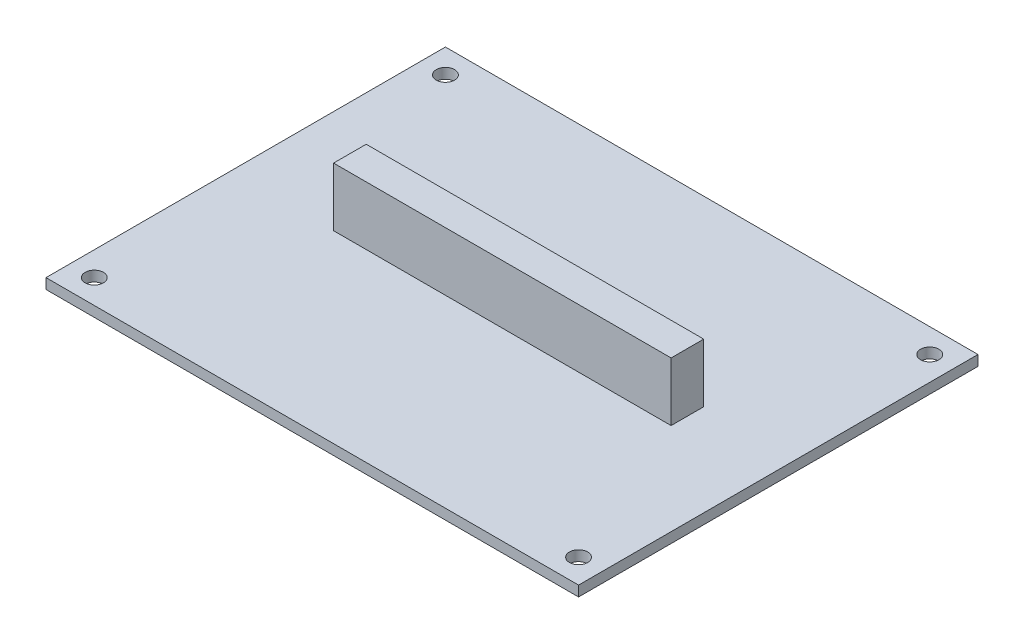
ISO-10303-21;
HEADER;
FILE_DESCRIPTION(('STEP AP214'),'2;1');
FILE_NAME('part.step','',(''),(''),'','','');
FILE_SCHEMA(('AUTOMOTIVE_DESIGN { 1 0 10303 214 1 1 1 1 }'));
ENDSEC;
DATA;
#1=APPLICATION_CONTEXT('core data for automotive mechanical design processes');
#2=APPLICATION_PROTOCOL_DEFINITION('international standard','automotive_design',2000,#1);
#3=PRODUCT_CONTEXT('',#1,'mechanical');
#4=PRODUCT('Part','Part','',(#3));
#5=PRODUCT_RELATED_PRODUCT_CATEGORY('part','',(#4));
#6=PRODUCT_DEFINITION_FORMATION('','',#4);
#7=PRODUCT_DEFINITION_CONTEXT('part definition',#1,'design');
#8=PRODUCT_DEFINITION('design','',#6,#7);
#9=PRODUCT_DEFINITION_SHAPE('','',#8);
#10=(LENGTH_UNIT() NAMED_UNIT(*) SI_UNIT(.MILLI.,.METRE.));
#11=(NAMED_UNIT(*) PLANE_ANGLE_UNIT() SI_UNIT($,.RADIAN.));
#12=(NAMED_UNIT(*) SI_UNIT($,.STERADIAN.) SOLID_ANGLE_UNIT());
#13=UNCERTAINTY_MEASURE_WITH_UNIT(LENGTH_MEASURE(1.E-05),#10,'distance_accuracy_value','');
#14=(GEOMETRIC_REPRESENTATION_CONTEXT(3) GLOBAL_UNCERTAINTY_ASSIGNED_CONTEXT((#13)) GLOBAL_UNIT_ASSIGNED_CONTEXT((#10,
#11,#12)) REPRESENTATION_CONTEXT('',''));
#15=CARTESIAN_POINT('',(0.,0.,0.));
#16=DIRECTION('',(0.,0.,1.));
#17=DIRECTION('',(1.,0.,0.));
#18=AXIS2_PLACEMENT_3D('',#15,#16,#17);
#19=CARTESIAN_POINT('',(0.,1.55,0.));
#20=DIRECTION('',(0.,-1.,0.));
#21=DIRECTION('',(0.,0.,-1.));
#22=AXIS2_PLACEMENT_3D('',#19,#20,#21);
#23=PLANE('',#22);
#24=CARTESIAN_POINT('',(36.375,1.55,26.375));
#25=DIRECTION('',(0.,1.,0.));
#26=DIRECTION('',(0.,0.,1.));
#27=AXIS2_PLACEMENT_3D('',#24,#25,#26);
#28=CIRCLE('',#27,1.375);
#29=CARTESIAN_POINT('',(36.375,1.55,27.75));
#30=VERTEX_POINT('',#29);
#31=EDGE_CURVE('E132',#30,#30,#28,.T.);
#32=ORIENTED_EDGE('',*,*,#31,.F.);
#33=EDGE_LOOP('',(#32));
#34=FACE_BOUND('',#33,.T.);
#35=CARTESIAN_POINT('',(-36.375,1.55,26.375));
#36=DIRECTION('',(0.,1.,0.));
#37=DIRECTION('',(0.,0.,1.));
#38=AXIS2_PLACEMENT_3D('',#35,#36,#37);
#39=CIRCLE('',#38,1.375);
#40=CARTESIAN_POINT('',(-36.375,1.55,27.75));
#41=VERTEX_POINT('',#40);
#42=EDGE_CURVE('E141',#41,#41,#39,.T.);
#43=ORIENTED_EDGE('',*,*,#42,.F.);
#44=EDGE_LOOP('',(#43));
#45=FACE_BOUND('',#44,.T.);
#46=CARTESIAN_POINT('',(-36.375,1.55,-26.375));
#47=DIRECTION('',(0.,1.,0.));
#48=DIRECTION('',(0.,0.,1.));
#49=AXIS2_PLACEMENT_3D('',#46,#47,#48);
#50=CIRCLE('',#49,1.375);
#51=CARTESIAN_POINT('',(-36.375,1.55,-25.));
#52=VERTEX_POINT('',#51);
#53=EDGE_CURVE('E147',#52,#52,#50,.T.);
#54=ORIENTED_EDGE('',*,*,#53,.F.);
#55=EDGE_LOOP('',(#54));
#56=FACE_BOUND('',#55,.T.);
#57=CARTESIAN_POINT('',(36.375,1.55,-26.375));
#58=DIRECTION('',(0.,1.,0.));
#59=DIRECTION('',(0.,0.,1.));
#60=AXIS2_PLACEMENT_3D('',#57,#58,#59);
#61=CIRCLE('',#60,1.375);
#62=CARTESIAN_POINT('',(36.375,1.55,-25.));
#63=VERTEX_POINT('',#62);
#64=EDGE_CURVE('E153',#63,#63,#61,.T.);
#65=ORIENTED_EDGE('',*,*,#64,.F.);
#66=EDGE_LOOP('',(#65));
#67=FACE_BOUND('',#66,.T.);
#68=DIRECTION('',(0.,0.,-1.));
#69=VECTOR('',#68,1.);
#70=CARTESIAN_POINT('',(40.,1.55,30.));
#71=LINE('',#70,#69);
#72=CARTESIAN_POINT('',(40.,1.55,30.));
#73=VERTEX_POINT('',#72);
#74=CARTESIAN_POINT('',(40.,1.55,-30.));
#75=VERTEX_POINT('',#74);
#76=EDGE_CURVE('E159',#73,#75,#71,.T.);
#77=ORIENTED_EDGE('',*,*,#76,.T.);
#78=DIRECTION('',(-1.,0.,0.));
#79=VECTOR('',#78,1.);
#80=CARTESIAN_POINT('',(-40.,1.55,-30.));
#81=LINE('',#80,#79);
#82=CARTESIAN_POINT('',(-40.,1.55,-30.));
#83=VERTEX_POINT('',#82);
#84=EDGE_CURVE('E162',#75,#83,#81,.T.);
#85=ORIENTED_EDGE('',*,*,#84,.T.);
#86=DIRECTION('',(0.,0.,1.));
#87=VECTOR('',#86,1.);
#88=CARTESIAN_POINT('',(-40.,1.55,30.));
#89=LINE('',#88,#87);
#90=CARTESIAN_POINT('',(-40.,1.55,30.));
#91=VERTEX_POINT('',#90);
#92=EDGE_CURVE('E165',#83,#91,#89,.T.);
#93=ORIENTED_EDGE('',*,*,#92,.T.);
#94=DIRECTION('',(1.,0.,0.));
#95=VECTOR('',#94,1.);
#96=CARTESIAN_POINT('',(-40.,1.55,30.));
#97=LINE('',#96,#95);
#98=EDGE_CURVE('E167',#91,#73,#97,.T.);
#99=ORIENTED_EDGE('',*,*,#98,.T.);
#100=EDGE_LOOP('',(#77,#85,#93,#99));
#101=FACE_BOUND('',#100,.T.);
#102=DIRECTION('',(0.,0.,1.));
#103=VECTOR('',#102,1.);
#104=CARTESIAN_POINT('',(-24.5,1.55,2.3));
#105=LINE('',#104,#103);
#106=CARTESIAN_POINT('',(-24.5,1.55,-2.6));
#107=VERTEX_POINT('',#106);
#108=CARTESIAN_POINT('',(-24.5,1.55,2.3));
#109=VERTEX_POINT('',#108);
#110=EDGE_CURVE('E128',#107,#109,#105,.T.);
#111=ORIENTED_EDGE('',*,*,#110,.F.);
#112=DIRECTION('',(-1.,0.,0.));
#113=VECTOR('',#112,1.);
#114=CARTESIAN_POINT('',(-24.5,1.55,-2.6));
#115=LINE('',#114,#113);
#116=CARTESIAN_POINT('',(26.2,1.55,-2.6));
#117=VERTEX_POINT('',#116);
#118=EDGE_CURVE('E125',#117,#107,#115,.T.);
#119=ORIENTED_EDGE('',*,*,#118,.F.);
#120=DIRECTION('',(0.,0.,-1.));
#121=VECTOR('',#120,1.);
#122=CARTESIAN_POINT('',(26.2,1.55,-2.6));
#123=LINE('',#122,#121);
#124=CARTESIAN_POINT('',(26.2,1.55,2.3));
#125=VERTEX_POINT('',#124);
#126=EDGE_CURVE('E63',#125,#117,#123,.T.);
#127=ORIENTED_EDGE('',*,*,#126,.F.);
#128=DIRECTION('',(1.,0.,0.));
#129=VECTOR('',#128,1.);
#130=CARTESIAN_POINT('',(26.2,1.55,2.3));
#131=LINE('',#130,#129);
#132=EDGE_CURVE('E58',#109,#125,#131,.T.);
#133=ORIENTED_EDGE('',*,*,#132,.F.);
#134=EDGE_LOOP('',(#111,#119,#127,#133));
#135=FACE_BOUND('',#134,.T.);
#136=ADVANCED_FACE('F43',(#34,#45,#56,#67,#101,#135),#23,.F.);
#137=CARTESIAN_POINT('',(0.,0.,0.));
#138=DIRECTION('',(0.,-1.,0.));
#139=DIRECTION('',(0.,0.,-1.));
#140=AXIS2_PLACEMENT_3D('',#137,#138,#139);
#141=PLANE('',#140);
#142=CARTESIAN_POINT('',(-36.375,0.,26.375));
#143=DIRECTION('',(0.,1.,0.));
#144=DIRECTION('',(0.,0.,1.));
#145=AXIS2_PLACEMENT_3D('',#142,#143,#144);
#146=CIRCLE('',#145,1.375);
#147=CARTESIAN_POINT('',(-36.375,0.,27.75));
#148=VERTEX_POINT('',#147);
#149=EDGE_CURVE('E139',#148,#148,#146,.T.);
#150=ORIENTED_EDGE('',*,*,#149,.T.);
#151=EDGE_LOOP('',(#150));
#152=FACE_BOUND('',#151,.T.);
#153=CARTESIAN_POINT('',(36.375,0.,-26.375));
#154=DIRECTION('',(0.,1.,0.));
#155=DIRECTION('',(0.,0.,1.));
#156=AXIS2_PLACEMENT_3D('',#153,#154,#155);
#157=CIRCLE('',#156,1.375);
#158=CARTESIAN_POINT('',(36.375,0.,-25.));
#159=VERTEX_POINT('',#158);
#160=EDGE_CURVE('E150',#159,#159,#157,.T.);
#161=ORIENTED_EDGE('',*,*,#160,.T.);
#162=EDGE_LOOP('',(#161));
#163=FACE_BOUND('',#162,.T.);
#164=DIRECTION('',(0.,0.,-1.));
#165=VECTOR('',#164,1.);
#166=CARTESIAN_POINT('',(40.,0.,30.));
#167=LINE('',#166,#165);
#168=CARTESIAN_POINT('',(40.,0.,30.));
#169=VERTEX_POINT('',#168);
#170=CARTESIAN_POINT('',(40.,0.,-30.));
#171=VERTEX_POINT('',#170);
#172=EDGE_CURVE('E156',#169,#171,#167,.T.);
#173=ORIENTED_EDGE('',*,*,#172,.F.);
#174=DIRECTION('',(1.,0.,0.));
#175=VECTOR('',#174,1.);
#176=CARTESIAN_POINT('',(-40.,0.,30.));
#177=LINE('',#176,#175);
#178=CARTESIAN_POINT('',(-40.,0.,30.));
#179=VERTEX_POINT('',#178);
#180=EDGE_CURVE('E163',#179,#169,#177,.T.);
#181=ORIENTED_EDGE('',*,*,#180,.F.);
#182=DIRECTION('',(0.,0.,1.));
#183=VECTOR('',#182,1.);
#184=CARTESIAN_POINT('',(-40.,0.,30.));
#185=LINE('',#184,#183);
#186=CARTESIAN_POINT('',(-40.,0.,-30.));
#187=VERTEX_POINT('',#186);
#188=EDGE_CURVE('E174',#187,#179,#185,.T.);
#189=ORIENTED_EDGE('',*,*,#188,.F.);
#190=DIRECTION('',(-1.,0.,0.));
#191=VECTOR('',#190,1.);
#192=CARTESIAN_POINT('',(-40.,0.,-30.));
#193=LINE('',#192,#191);
#194=EDGE_CURVE('E172',#171,#187,#193,.T.);
#195=ORIENTED_EDGE('',*,*,#194,.F.);
#196=EDGE_LOOP('',(#173,#181,#189,#195));
#197=FACE_BOUND('',#196,.T.);
#198=CARTESIAN_POINT('',(-36.375,0.,-26.375));
#199=DIRECTION('',(0.,1.,0.));
#200=DIRECTION('',(0.,0.,1.));
#201=AXIS2_PLACEMENT_3D('',#198,#199,#200);
#202=CIRCLE('',#201,1.375);
#203=CARTESIAN_POINT('',(-36.375,0.,-25.));
#204=VERTEX_POINT('',#203);
#205=EDGE_CURVE('E144',#204,#204,#202,.T.);
#206=ORIENTED_EDGE('',*,*,#205,.T.);
#207=EDGE_LOOP('',(#206));
#208=FACE_BOUND('',#207,.T.);
#209=CARTESIAN_POINT('',(36.375,0.,26.375));
#210=DIRECTION('',(0.,1.,0.));
#211=DIRECTION('',(0.,0.,1.));
#212=AXIS2_PLACEMENT_3D('',#209,#210,#211);
#213=CIRCLE('',#212,1.375);
#214=CARTESIAN_POINT('',(36.375,0.,27.75));
#215=VERTEX_POINT('',#214);
#216=EDGE_CURVE('E129',#215,#215,#213,.T.);
#217=ORIENTED_EDGE('',*,*,#216,.T.);
#218=EDGE_LOOP('',(#217));
#219=FACE_BOUND('',#218,.T.);
#220=ADVANCED_FACE('F192',(#152,#163,#197,#208,#219),#141,.T.);
#221=CARTESIAN_POINT('',(40.,1.55,30.));
#222=DIRECTION('',(-1.,0.,0.));
#223=DIRECTION('',(0.,0.,1.));
#224=AXIS2_PLACEMENT_3D('',#221,#222,#223);
#225=PLANE('',#224);
#226=ORIENTED_EDGE('',*,*,#172,.T.);
#227=DIRECTION('',(0.,-1.,0.));
#228=VECTOR('',#227,1.);
#229=CARTESIAN_POINT('',(40.,1.55,-30.));
#230=LINE('',#229,#228);
#231=EDGE_CURVE('E11',#75,#171,#230,.T.);
#232=ORIENTED_EDGE('',*,*,#231,.F.);
#233=ORIENTED_EDGE('',*,*,#76,.F.);
#234=DIRECTION('',(0.,-1.,0.));
#235=VECTOR('',#234,1.);
#236=CARTESIAN_POINT('',(40.,1.55,30.));
#237=LINE('',#236,#235);
#238=EDGE_CURVE('E169',#73,#169,#237,.T.);
#239=ORIENTED_EDGE('',*,*,#238,.T.);
#240=EDGE_LOOP('',(#226,#232,#233,#239));
#241=FACE_BOUND('',#240,.T.);
#242=ADVANCED_FACE('F45',(#241),#225,.F.);
#243=CARTESIAN_POINT('',(-40.,1.55,-30.));
#244=DIRECTION('',(0.,0.,1.));
#245=DIRECTION('',(1.,0.,0.));
#246=AXIS2_PLACEMENT_3D('',#243,#244,#245);
#247=PLANE('',#246);
#248=ORIENTED_EDGE('',*,*,#194,.T.);
#249=DIRECTION('',(0.,-1.,0.));
#250=VECTOR('',#249,1.);
#251=CARTESIAN_POINT('',(-40.,1.55,-30.));
#252=LINE('',#251,#250);
#253=EDGE_CURVE('E51',#83,#187,#252,.T.);
#254=ORIENTED_EDGE('',*,*,#253,.F.);
#255=ORIENTED_EDGE('',*,*,#84,.F.);
#256=ORIENTED_EDGE('',*,*,#231,.T.);
#257=EDGE_LOOP('',(#248,#254,#255,#256));
#258=FACE_BOUND('',#257,.T.);
#259=ADVANCED_FACE('F202',(#258),#247,.F.);
#260=CARTESIAN_POINT('',(-40.,1.55,30.));
#261=DIRECTION('',(1.,0.,0.));
#262=DIRECTION('',(0.,0.,-1.));
#263=AXIS2_PLACEMENT_3D('',#260,#261,#262);
#264=PLANE('',#263);
#265=ORIENTED_EDGE('',*,*,#188,.T.);
#266=DIRECTION('',(0.,-1.,0.));
#267=VECTOR('',#266,1.);
#268=CARTESIAN_POINT('',(-40.,1.55,30.));
#269=LINE('',#268,#267);
#270=EDGE_CURVE('E179',#91,#179,#269,.T.);
#271=ORIENTED_EDGE('',*,*,#270,.F.);
#272=ORIENTED_EDGE('',*,*,#92,.F.);
#273=ORIENTED_EDGE('',*,*,#253,.T.);
#274=EDGE_LOOP('',(#265,#271,#272,#273));
#275=FACE_BOUND('',#274,.T.);
#276=ADVANCED_FACE('F186',(#275),#264,.F.);
#277=CARTESIAN_POINT('',(-40.,1.55,30.));
#278=DIRECTION('',(0.,0.,-1.));
#279=DIRECTION('',(-1.,0.,0.));
#280=AXIS2_PLACEMENT_3D('',#277,#278,#279);
#281=PLANE('',#280);
#282=ORIENTED_EDGE('',*,*,#180,.T.);
#283=ORIENTED_EDGE('',*,*,#238,.F.);
#284=ORIENTED_EDGE('',*,*,#98,.F.);
#285=ORIENTED_EDGE('',*,*,#270,.T.);
#286=EDGE_LOOP('',(#282,#283,#284,#285));
#287=FACE_BOUND('',#286,.T.);
#288=ADVANCED_FACE('F196',(#287),#281,.F.);
#289=CARTESIAN_POINT('',(36.375,1.55,-26.375));
#290=DIRECTION('',(0.,-1.,0.));
#291=DIRECTION('',(0.,0.,-1.));
#292=AXIS2_PLACEMENT_3D('',#289,#290,#291);
#293=CYLINDRICAL_SURFACE('',#292,1.375);
#294=ORIENTED_EDGE('',*,*,#64,.T.);
#295=EDGE_LOOP('',(#294));
#296=FACE_BOUND('',#295,.T.);
#297=ORIENTED_EDGE('',*,*,#160,.F.);
#298=EDGE_LOOP('',(#297));
#299=FACE_BOUND('',#298,.T.);
#300=ADVANCED_FACE('F222',(#296,#299),#293,.F.);
#301=CARTESIAN_POINT('',(-36.375,1.55,-26.375));
#302=DIRECTION('',(0.,-1.,0.));
#303=DIRECTION('',(0.,0.,-1.));
#304=AXIS2_PLACEMENT_3D('',#301,#302,#303);
#305=CYLINDRICAL_SURFACE('',#304,1.375);
#306=ORIENTED_EDGE('',*,*,#53,.T.);
#307=EDGE_LOOP('',(#306));
#308=FACE_BOUND('',#307,.T.);
#309=ORIENTED_EDGE('',*,*,#205,.F.);
#310=EDGE_LOOP('',(#309));
#311=FACE_BOUND('',#310,.T.);
#312=ADVANCED_FACE('F229',(#308,#311),#305,.F.);
#313=CARTESIAN_POINT('',(-36.375,1.55,26.375));
#314=DIRECTION('',(0.,-1.,0.));
#315=DIRECTION('',(0.,0.,-1.));
#316=AXIS2_PLACEMENT_3D('',#313,#314,#315);
#317=CYLINDRICAL_SURFACE('',#316,1.375);
#318=ORIENTED_EDGE('',*,*,#42,.T.);
#319=EDGE_LOOP('',(#318));
#320=FACE_BOUND('',#319,.T.);
#321=ORIENTED_EDGE('',*,*,#149,.F.);
#322=EDGE_LOOP('',(#321));
#323=FACE_BOUND('',#322,.T.);
#324=ADVANCED_FACE('F234',(#320,#323),#317,.F.);
#325=CARTESIAN_POINT('',(36.375,1.55,26.375));
#326=DIRECTION('',(0.,-1.,0.));
#327=DIRECTION('',(0.,0.,-1.));
#328=AXIS2_PLACEMENT_3D('',#325,#326,#327);
#329=CYLINDRICAL_SURFACE('',#328,1.375);
#330=ORIENTED_EDGE('',*,*,#31,.T.);
#331=EDGE_LOOP('',(#330));
#332=FACE_BOUND('',#331,.T.);
#333=ORIENTED_EDGE('',*,*,#216,.F.);
#334=EDGE_LOOP('',(#333));
#335=FACE_BOUND('',#334,.T.);
#336=ADVANCED_FACE('F244',(#332,#335),#329,.F.);
#337=CARTESIAN_POINT('',(-24.5,10.35,2.3));
#338=DIRECTION('',(1.,0.,0.));
#339=DIRECTION('',(0.,0.,-1.));
#340=AXIS2_PLACEMENT_3D('',#337,#338,#339);
#341=PLANE('',#340);
#342=ORIENTED_EDGE('',*,*,#110,.T.);
#343=DIRECTION('',(0.,-1.,0.));
#344=VECTOR('',#343,1.);
#345=CARTESIAN_POINT('',(-24.5,10.35,2.3));
#346=LINE('',#345,#344);
#347=CARTESIAN_POINT('',(-24.5,10.35,2.3));
#348=VERTEX_POINT('',#347);
#349=EDGE_CURVE('E109',#348,#109,#346,.T.);
#350=ORIENTED_EDGE('',*,*,#349,.F.);
#351=DIRECTION('',(0.,0.,1.));
#352=VECTOR('',#351,1.);
#353=CARTESIAN_POINT('',(-24.5,10.35,2.3));
#354=LINE('',#353,#352);
#355=CARTESIAN_POINT('',(-24.5,10.35,-2.6));
#356=VERTEX_POINT('',#355);
#357=EDGE_CURVE('E116',#356,#348,#354,.T.);
#358=ORIENTED_EDGE('',*,*,#357,.F.);
#359=DIRECTION('',(0.,-1.,0.));
#360=VECTOR('',#359,1.);
#361=CARTESIAN_POINT('',(-24.5,10.35,-2.6));
#362=LINE('',#361,#360);
#363=EDGE_CURVE('E345',#356,#107,#362,.T.);
#364=ORIENTED_EDGE('',*,*,#363,.T.);
#365=EDGE_LOOP('',(#342,#350,#358,#364));
#366=FACE_BOUND('',#365,.T.);
#367=ADVANCED_FACE('F127',(#366),#341,.F.);
#368=CARTESIAN_POINT('',(26.2,10.35,2.3));
#369=DIRECTION('',(0.,0.,-1.));
#370=DIRECTION('',(-1.,0.,0.));
#371=AXIS2_PLACEMENT_3D('',#368,#369,#370);
#372=PLANE('',#371);
#373=ORIENTED_EDGE('',*,*,#132,.T.);
#374=DIRECTION('',(0.,-1.,0.));
#375=VECTOR('',#374,1.);
#376=CARTESIAN_POINT('',(26.2,10.35,2.3));
#377=LINE('',#376,#375);
#378=CARTESIAN_POINT('',(26.2,10.35,2.3));
#379=VERTEX_POINT('',#378);
#380=EDGE_CURVE('E112',#379,#125,#377,.T.);
#381=ORIENTED_EDGE('',*,*,#380,.F.);
#382=DIRECTION('',(1.,0.,0.));
#383=VECTOR('',#382,1.);
#384=CARTESIAN_POINT('',(26.2,10.35,2.3));
#385=LINE('',#384,#383);
#386=EDGE_CURVE('E105',#348,#379,#385,.T.);
#387=ORIENTED_EDGE('',*,*,#386,.F.);
#388=ORIENTED_EDGE('',*,*,#349,.T.);
#389=EDGE_LOOP('',(#373,#381,#387,#388));
#390=FACE_BOUND('',#389,.T.);
#391=ADVANCED_FACE('F107',(#390),#372,.F.);
#392=CARTESIAN_POINT('',(26.2,10.35,-2.6));
#393=DIRECTION('',(-1.,0.,0.));
#394=DIRECTION('',(0.,0.,1.));
#395=AXIS2_PLACEMENT_3D('',#392,#393,#394);
#396=PLANE('',#395);
#397=ORIENTED_EDGE('',*,*,#126,.T.);
#398=DIRECTION('',(0.,-1.,0.));
#399=VECTOR('',#398,1.);
#400=CARTESIAN_POINT('',(26.2,10.35,-2.6));
#401=LINE('',#400,#399);
#402=CARTESIAN_POINT('',(26.2,10.35,-2.6));
#403=VERTEX_POINT('',#402);
#404=EDGE_CURVE('E134',#403,#117,#401,.T.);
#405=ORIENTED_EDGE('',*,*,#404,.F.);
#406=DIRECTION('',(0.,0.,-1.));
#407=VECTOR('',#406,1.);
#408=CARTESIAN_POINT('',(26.2,10.35,-2.6));
#409=LINE('',#408,#407);
#410=EDGE_CURVE('E115',#379,#403,#409,.T.);
#411=ORIENTED_EDGE('',*,*,#410,.F.);
#412=ORIENTED_EDGE('',*,*,#380,.T.);
#413=EDGE_LOOP('',(#397,#405,#411,#412));
#414=FACE_BOUND('',#413,.T.);
#415=ADVANCED_FACE('F254',(#414),#396,.F.);
#416=CARTESIAN_POINT('',(-24.5,10.35,-2.6));
#417=DIRECTION('',(0.,0.,1.));
#418=DIRECTION('',(1.,0.,0.));
#419=AXIS2_PLACEMENT_3D('',#416,#417,#418);
#420=PLANE('',#419);
#421=ORIENTED_EDGE('',*,*,#118,.T.);
#422=ORIENTED_EDGE('',*,*,#363,.F.);
#423=DIRECTION('',(-1.,0.,0.));
#424=VECTOR('',#423,1.);
#425=CARTESIAN_POINT('',(-24.5,10.35,-2.6));
#426=LINE('',#425,#424);
#427=EDGE_CURVE('E121',#403,#356,#426,.T.);
#428=ORIENTED_EDGE('',*,*,#427,.F.);
#429=ORIENTED_EDGE('',*,*,#404,.T.);
#430=EDGE_LOOP('',(#421,#422,#428,#429));
#431=FACE_BOUND('',#430,.T.);
#432=ADVANCED_FACE('F257',(#431),#420,.F.);
#433=CARTESIAN_POINT('',(0.,10.35,0.));
#434=DIRECTION('',(0.,-1.,0.));
#435=DIRECTION('',(0.,0.,-1.));
#436=AXIS2_PLACEMENT_3D('',#433,#434,#435);
#437=PLANE('',#436);
#438=ORIENTED_EDGE('',*,*,#357,.T.);
#439=ORIENTED_EDGE('',*,*,#386,.T.);
#440=ORIENTED_EDGE('',*,*,#410,.T.);
#441=ORIENTED_EDGE('',*,*,#427,.T.);
#442=EDGE_LOOP('',(#438,#439,#440,#441));
#443=FACE_BOUND('',#442,.T.);
#444=ADVANCED_FACE('F119',(#443),#437,.F.);
#445=CLOSED_SHELL('',(#136,#220,#242,#259,#276,#288,#300,#312,#324,#336,#367,#391,#415,#432,#444));
#446=MANIFOLD_SOLID_BREP('B2',#445);
#447=ADVANCED_BREP_SHAPE_REPRESENTATION('',(#18,#446),#14);
#448=SHAPE_DEFINITION_REPRESENTATION(#9,#447);
ENDSEC;
END-ISO-10303-21;
